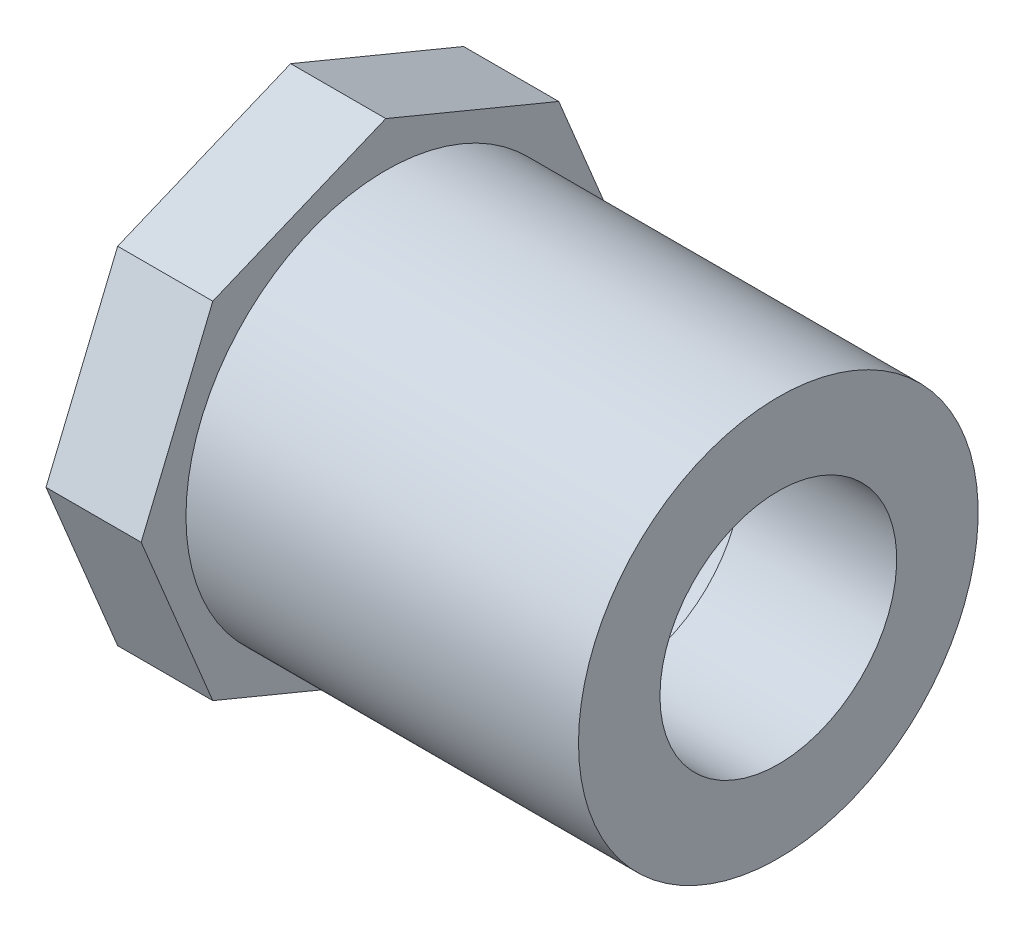
ISO-10303-21;
HEADER;
FILE_DESCRIPTION(('STEP AP214'),'2;1');
FILE_NAME('part.step','',(''),(''),'','','');
FILE_SCHEMA(('AUTOMOTIVE_DESIGN { 1 0 10303 214 1 1 1 1 }'));
ENDSEC;
DATA;
#1=APPLICATION_CONTEXT('core data for automotive mechanical design processes');
#2=APPLICATION_PROTOCOL_DEFINITION('international standard','automotive_design',2000,#1);
#3=PRODUCT_CONTEXT('',#1,'mechanical');
#4=PRODUCT('Part','Part','',(#3));
#5=PRODUCT_RELATED_PRODUCT_CATEGORY('part','',(#4));
#6=PRODUCT_DEFINITION_FORMATION('','',#4);
#7=PRODUCT_DEFINITION_CONTEXT('part definition',#1,'design');
#8=PRODUCT_DEFINITION('design','',#6,#7);
#9=PRODUCT_DEFINITION_SHAPE('','',#8);
#10=(LENGTH_UNIT() NAMED_UNIT(*) SI_UNIT(.MILLI.,.METRE.));
#11=(NAMED_UNIT(*) PLANE_ANGLE_UNIT() SI_UNIT($,.RADIAN.));
#12=(NAMED_UNIT(*) SI_UNIT($,.STERADIAN.) SOLID_ANGLE_UNIT());
#13=UNCERTAINTY_MEASURE_WITH_UNIT(LENGTH_MEASURE(1.E-05),#10,'distance_accuracy_value','');
#14=(GEOMETRIC_REPRESENTATION_CONTEXT(3) GLOBAL_UNCERTAINTY_ASSIGNED_CONTEXT((#13)) GLOBAL_UNIT_ASSIGNED_CONTEXT((#10,
#11,#12)) REPRESENTATION_CONTEXT('',''));
#15=CARTESIAN_POINT('',(0.,0.,0.));
#16=DIRECTION('',(0.,0.,1.));
#17=DIRECTION('',(1.,0.,0.));
#18=AXIS2_PLACEMENT_3D('',#15,#16,#17);
#19=CARTESIAN_POINT('',(-32.54375,0.,0.));
#20=DIRECTION('',(-1.,0.,0.));
#21=DIRECTION('',(0.,0.,1.));
#22=AXIS2_PLACEMENT_3D('',#19,#20,#21);
#23=CYLINDRICAL_SURFACE('',#22,13.335);
#24=CARTESIAN_POINT('',(0.,0.,0.));
#25=DIRECTION('',(-1.,0.,0.));
#26=DIRECTION('',(0.,0.,1.));
#27=AXIS2_PLACEMENT_3D('',#24,#25,#26);
#28=CIRCLE('',#27,13.335);
#29=CARTESIAN_POINT('',(0.,0.,13.335));
#30=VERTEX_POINT('',#29);
#31=EDGE_CURVE('E165',#30,#30,#28,.T.);
#32=ORIENTED_EDGE('',*,*,#31,.T.);
#33=EDGE_LOOP('',(#32));
#34=FACE_BOUND('',#33,.T.);
#35=CARTESIAN_POINT('',(-26.19375,0.,0.));
#36=DIRECTION('',(-1.,0.,0.));
#37=DIRECTION('',(0.,0.,1.));
#38=AXIS2_PLACEMENT_3D('',#35,#36,#37);
#39=CIRCLE('',#38,13.335);
#40=CARTESIAN_POINT('',(-26.19375,0.,13.335));
#41=VERTEX_POINT('',#40);
#42=EDGE_CURVE('E36',#41,#41,#39,.F.);
#43=ORIENTED_EDGE('',*,*,#42,.T.);
#44=EDGE_LOOP('',(#43));
#45=FACE_BOUND('',#44,.T.);
#46=ADVANCED_FACE('F32',(#34,#45),#23,.T.);
#47=CARTESIAN_POINT('',(-32.54375,-13.335,0.));
#48=DIRECTION('',(-1.,0.,0.));
#49=DIRECTION('',(0.,0.,1.));
#50=AXIS2_PLACEMENT_3D('',#47,#48,#49);
#51=PLANE('',#50);
#52=CARTESIAN_POINT('',(-32.54375,0.,0.));
#53=DIRECTION('',(-1.,0.,0.));
#54=DIRECTION('',(0.,0.,1.));
#55=AXIS2_PLACEMENT_3D('',#52,#53,#54);
#56=CIRCLE('',#55,10.7696);
#57=CARTESIAN_POINT('',(-32.54375,0.,10.7696));
#58=VERTEX_POINT('',#57);
#59=EDGE_CURVE('E11',#58,#58,#56,.T.);
#60=ORIENTED_EDGE('',*,*,#59,.F.);
#61=EDGE_LOOP('',(#60));
#62=FACE_BOUND('',#61,.T.);
#63=DIRECTION('',(0.,0.923879532511287,0.38268343236509));
#64=VECTOR('',#63,1.);
#65=CARTESIAN_POINT('',(-32.54375,-11.542689028712,11.542689028712));
#66=LINE('',#65,#64);
#67=CARTESIAN_POINT('',(-32.54375,-11.542689028712,11.542689028712));
#68=VERTEX_POINT('',#67);
#69=CARTESIAN_POINT('',(-32.54375,0.,16.3238273706597));
#70=VERTEX_POINT('',#69);
#71=EDGE_CURVE('E133',#68,#70,#66,.T.);
#72=ORIENTED_EDGE('',*,*,#71,.T.);
#73=DIRECTION('',(0.,0.923879532511287,-0.38268343236509));
#74=VECTOR('',#73,1.);
#75=CARTESIAN_POINT('',(-32.54375,0.,16.3238273706597));
#76=LINE('',#75,#74);
#77=CARTESIAN_POINT('',(-32.54375,11.542689028712,11.542689028712));
#78=VERTEX_POINT('',#77);
#79=EDGE_CURVE('E136',#70,#78,#76,.T.);
#80=ORIENTED_EDGE('',*,*,#79,.T.);
#81=DIRECTION('',(0.,0.38268343236509,-0.923879532511287));
#82=VECTOR('',#81,1.);
#83=CARTESIAN_POINT('',(-32.54375,11.542689028712,11.542689028712));
#84=LINE('',#83,#82);
#85=CARTESIAN_POINT('',(-32.54375,16.3238273706597,0.));
#86=VERTEX_POINT('',#85);
#87=EDGE_CURVE('E139',#78,#86,#84,.T.);
#88=ORIENTED_EDGE('',*,*,#87,.T.);
#89=DIRECTION('',(0.,-0.38268343236509,-0.923879532511287));
#90=VECTOR('',#89,1.);
#91=CARTESIAN_POINT('',(-32.54375,16.3238273706597,0.));
#92=LINE('',#91,#90);
#93=CARTESIAN_POINT('',(-32.54375,11.542689028712,-11.542689028712));
#94=VERTEX_POINT('',#93);
#95=EDGE_CURVE('E142',#86,#94,#92,.T.);
#96=ORIENTED_EDGE('',*,*,#95,.T.);
#97=DIRECTION('',(0.,-0.923879532511287,-0.38268343236509));
#98=VECTOR('',#97,1.);
#99=CARTESIAN_POINT('',(-32.54375,11.542689028712,-11.542689028712));
#100=LINE('',#99,#98);
#101=CARTESIAN_POINT('',(-32.54375,0.,-16.3238273706597));
#102=VERTEX_POINT('',#101);
#103=EDGE_CURVE('E145',#94,#102,#100,.T.);
#104=ORIENTED_EDGE('',*,*,#103,.T.);
#105=DIRECTION('',(0.,-0.923879532511287,0.382683432365089));
#106=VECTOR('',#105,1.);
#107=CARTESIAN_POINT('',(-32.54375,0.,-16.3238273706597));
#108=LINE('',#107,#106);
#109=CARTESIAN_POINT('',(-32.54375,-11.542689028712,-11.542689028712));
#110=VERTEX_POINT('',#109);
#111=EDGE_CURVE('E148',#102,#110,#108,.T.);
#112=ORIENTED_EDGE('',*,*,#111,.T.);
#113=DIRECTION('',(0.,-0.38268343236509,0.923879532511287));
#114=VECTOR('',#113,1.);
#115=CARTESIAN_POINT('',(-32.54375,-11.542689028712,-11.542689028712));
#116=LINE('',#115,#114);
#117=CARTESIAN_POINT('',(-32.54375,-16.3238273706597,0.));
#118=VERTEX_POINT('',#117);
#119=EDGE_CURVE('E110',#110,#118,#116,.T.);
#120=ORIENTED_EDGE('',*,*,#119,.T.);
#121=DIRECTION('',(0.,0.382683432365089,0.923879532511287));
#122=VECTOR('',#121,1.);
#123=CARTESIAN_POINT('',(-32.54375,-16.3238273706597,0.));
#124=LINE('',#123,#122);
#125=EDGE_CURVE('E151',#118,#68,#124,.T.);
#126=ORIENTED_EDGE('',*,*,#125,.T.);
#127=EDGE_LOOP('',(#72,#80,#88,#96,#104,#112,#120,#126));
#128=FACE_BOUND('',#127,.T.);
#129=ADVANCED_FACE('F34',(#62,#128),#51,.T.);
#130=CARTESIAN_POINT('',(-10.31875,0.,0.));
#131=DIRECTION('',(-1.,0.,0.));
#132=DIRECTION('',(0.,0.,1.));
#133=AXIS2_PLACEMENT_3D('',#130,#131,#132);
#134=CONICAL_SURFACE('',#133,10.6172,0.00685703538495623);
#135=ORIENTED_EDGE('',*,*,#59,.T.);
#136=EDGE_LOOP('',(#135));
#137=FACE_BOUND('',#136,.T.);
#138=CARTESIAN_POINT('',(-10.31875,0.,0.));
#139=DIRECTION('',(-1.,0.,0.));
#140=DIRECTION('',(0.,0.,1.));
#141=AXIS2_PLACEMENT_3D('',#138,#139,#140);
#142=CIRCLE('',#141,10.6172);
#143=CARTESIAN_POINT('',(-10.31875,0.,10.6172));
#144=VERTEX_POINT('',#143);
#145=EDGE_CURVE('E42',#144,#144,#142,.T.);
#146=ORIENTED_EDGE('',*,*,#145,.F.);
#147=EDGE_LOOP('',(#146));
#148=FACE_BOUND('',#147,.T.);
#149=ADVANCED_FACE('F180',(#137,#148),#134,.F.);
#150=CARTESIAN_POINT('',(-10.31875,-7.8994,0.));
#151=DIRECTION('',(-1.,0.,0.));
#152=DIRECTION('',(0.,0.,1.));
#153=AXIS2_PLACEMENT_3D('',#150,#151,#152);
#154=PLANE('',#153);
#155=ORIENTED_EDGE('',*,*,#145,.T.);
#156=EDGE_LOOP('',(#155));
#157=FACE_BOUND('',#156,.T.);
#158=CARTESIAN_POINT('',(-10.31875,0.,0.));
#159=DIRECTION('',(-1.,0.,0.));
#160=DIRECTION('',(0.,0.,1.));
#161=AXIS2_PLACEMENT_3D('',#158,#159,#160);
#162=CIRCLE('',#161,7.8994);
#163=CARTESIAN_POINT('',(-10.31875,0.,7.8994));
#164=VERTEX_POINT('',#163);
#165=EDGE_CURVE('E171',#164,#164,#162,.T.);
#166=ORIENTED_EDGE('',*,*,#165,.F.);
#167=EDGE_LOOP('',(#166));
#168=FACE_BOUND('',#167,.T.);
#169=ADVANCED_FACE('F177',(#157,#168),#154,.T.);
#170=CARTESIAN_POINT('',(-32.54375,0.,0.));
#171=DIRECTION('',(-1.,0.,0.));
#172=DIRECTION('',(0.,0.,1.));
#173=AXIS2_PLACEMENT_3D('',#170,#171,#172);
#174=CYLINDRICAL_SURFACE('',#173,7.8994);
#175=ORIENTED_EDGE('',*,*,#165,.T.);
#176=EDGE_LOOP('',(#175));
#177=FACE_BOUND('',#176,.T.);
#178=CARTESIAN_POINT('',(0.,0.,0.));
#179=DIRECTION('',(-1.,0.,0.));
#180=DIRECTION('',(0.,0.,1.));
#181=AXIS2_PLACEMENT_3D('',#178,#179,#180);
#182=CIRCLE('',#181,7.8994);
#183=CARTESIAN_POINT('',(0.,0.,7.8994));
#184=VERTEX_POINT('',#183);
#185=EDGE_CURVE('E168',#184,#184,#182,.T.);
#186=ORIENTED_EDGE('',*,*,#185,.F.);
#187=EDGE_LOOP('',(#186));
#188=FACE_BOUND('',#187,.T.);
#189=ADVANCED_FACE('F187',(#177,#188),#174,.F.);
#190=CARTESIAN_POINT('',(0.,-7.8994,0.));
#191=DIRECTION('',(1.,0.,0.));
#192=DIRECTION('',(0.,0.,-1.));
#193=AXIS2_PLACEMENT_3D('',#190,#191,#192);
#194=PLANE('',#193);
#195=ORIENTED_EDGE('',*,*,#185,.T.);
#196=EDGE_LOOP('',(#195));
#197=FACE_BOUND('',#196,.T.);
#198=ORIENTED_EDGE('',*,*,#31,.F.);
#199=EDGE_LOOP('',(#198));
#200=FACE_BOUND('',#199,.T.);
#201=ADVANCED_FACE('F200',(#197,#200),#194,.T.);
#202=CARTESIAN_POINT('',(-26.19375,-11.542689028712,11.542689028712));
#203=DIRECTION('',(0.,-0.38268343236509,0.923879532511287));
#204=DIRECTION('',(0.,-0.923879532511287,-0.38268343236509));
#205=AXIS2_PLACEMENT_3D('',#202,#203,#204);
#206=PLANE('',#205);
#207=ORIENTED_EDGE('',*,*,#71,.F.);
#208=DIRECTION('',(-1.,0.,0.));
#209=VECTOR('',#208,1.);
#210=CARTESIAN_POINT('',(-26.19375,-11.542689028712,11.542689028712));
#211=LINE('',#210,#209);
#212=CARTESIAN_POINT('',(-26.19375,-11.542689028712,11.542689028712));
#213=VERTEX_POINT('',#212);
#214=EDGE_CURVE('E50',#213,#68,#211,.T.);
#215=ORIENTED_EDGE('',*,*,#214,.F.);
#216=DIRECTION('',(0.,0.923879532511287,0.38268343236509));
#217=VECTOR('',#216,1.);
#218=CARTESIAN_POINT('',(-26.19375,-11.542689028712,11.542689028712));
#219=LINE('',#218,#217);
#220=CARTESIAN_POINT('',(-26.19375,0.,16.3238273706597));
#221=VERTEX_POINT('',#220);
#222=EDGE_CURVE('E154',#213,#221,#219,.T.);
#223=ORIENTED_EDGE('',*,*,#222,.T.);
#224=DIRECTION('',(-1.,0.,0.));
#225=VECTOR('',#224,1.);
#226=CARTESIAN_POINT('',(-26.19375,0.,16.3238273706597));
#227=LINE('',#226,#225);
#228=EDGE_CURVE('E91',#221,#70,#227,.T.);
#229=ORIENTED_EDGE('',*,*,#228,.T.);
#230=EDGE_LOOP('',(#207,#215,#223,#229));
#231=FACE_BOUND('',#230,.T.);
#232=ADVANCED_FACE('F198',(#231),#206,.T.);
#233=CARTESIAN_POINT('',(-26.19375,-16.3238273706597,0.));
#234=DIRECTION('',(0.,-0.923879532511287,0.382683432365089));
#235=DIRECTION('',(0.,-0.382683432365089,-0.923879532511287));
#236=AXIS2_PLACEMENT_3D('',#233,#234,#235);
#237=PLANE('',#236);
#238=ORIENTED_EDGE('',*,*,#125,.F.);
#239=DIRECTION('',(-1.,0.,0.));
#240=VECTOR('',#239,1.);
#241=CARTESIAN_POINT('',(-26.19375,-16.3238273706597,0.));
#242=LINE('',#241,#240);
#243=CARTESIAN_POINT('',(-26.19375,-16.3238273706597,0.));
#244=VERTEX_POINT('',#243);
#245=EDGE_CURVE('E79',#244,#118,#242,.T.);
#246=ORIENTED_EDGE('',*,*,#245,.F.);
#247=DIRECTION('',(0.,0.382683432365089,0.923879532511287));
#248=VECTOR('',#247,1.);
#249=CARTESIAN_POINT('',(-26.19375,-16.3238273706597,0.));
#250=LINE('',#249,#248);
#251=EDGE_CURVE('E123',#244,#213,#250,.T.);
#252=ORIENTED_EDGE('',*,*,#251,.T.);
#253=ORIENTED_EDGE('',*,*,#214,.T.);
#254=EDGE_LOOP('',(#238,#246,#252,#253));
#255=FACE_BOUND('',#254,.T.);
#256=ADVANCED_FACE('F225',(#255),#237,.T.);
#257=CARTESIAN_POINT('',(-26.19375,-11.542689028712,-11.542689028712));
#258=DIRECTION('',(0.,-0.923879532511287,-0.38268343236509));
#259=DIRECTION('',(0.,0.38268343236509,-0.923879532511287));
#260=AXIS2_PLACEMENT_3D('',#257,#258,#259);
#261=PLANE('',#260);
#262=ORIENTED_EDGE('',*,*,#119,.F.);
#263=DIRECTION('',(-1.,0.,0.));
#264=VECTOR('',#263,1.);
#265=CARTESIAN_POINT('',(-26.19375,-11.542689028712,-11.542689028712));
#266=LINE('',#265,#264);
#267=CARTESIAN_POINT('',(-26.19375,-11.542689028712,-11.542689028712));
#268=VERTEX_POINT('',#267);
#269=EDGE_CURVE('E105',#268,#110,#266,.T.);
#270=ORIENTED_EDGE('',*,*,#269,.F.);
#271=DIRECTION('',(0.,-0.38268343236509,0.923879532511287));
#272=VECTOR('',#271,1.);
#273=CARTESIAN_POINT('',(-26.19375,-11.542689028712,-11.542689028712));
#274=LINE('',#273,#272);
#275=EDGE_CURVE('E108',#268,#244,#274,.T.);
#276=ORIENTED_EDGE('',*,*,#275,.T.);
#277=ORIENTED_EDGE('',*,*,#245,.T.);
#278=EDGE_LOOP('',(#262,#270,#276,#277));
#279=FACE_BOUND('',#278,.T.);
#280=ADVANCED_FACE('F107',(#279),#261,.T.);
#281=CARTESIAN_POINT('',(-26.19375,0.,-16.3238273706597));
#282=DIRECTION('',(0.,-0.382683432365089,-0.923879532511287));
#283=DIRECTION('',(0.,0.923879532511287,-0.382683432365089));
#284=AXIS2_PLACEMENT_3D('',#281,#282,#283);
#285=PLANE('',#284);
#286=ORIENTED_EDGE('',*,*,#111,.F.);
#287=DIRECTION('',(-1.,0.,0.));
#288=VECTOR('',#287,1.);
#289=CARTESIAN_POINT('',(-26.19375,0.,-16.3238273706597));
#290=LINE('',#289,#288);
#291=CARTESIAN_POINT('',(-26.19375,0.,-16.3238273706597));
#292=VERTEX_POINT('',#291);
#293=EDGE_CURVE('E115',#292,#102,#290,.T.);
#294=ORIENTED_EDGE('',*,*,#293,.F.);
#295=DIRECTION('',(0.,-0.923879532511287,0.382683432365089));
#296=VECTOR('',#295,1.);
#297=CARTESIAN_POINT('',(-26.19375,0.,-16.3238273706597));
#298=LINE('',#297,#296);
#299=EDGE_CURVE('E121',#292,#268,#298,.T.);
#300=ORIENTED_EDGE('',*,*,#299,.T.);
#301=ORIENTED_EDGE('',*,*,#269,.T.);
#302=EDGE_LOOP('',(#286,#294,#300,#301));
#303=FACE_BOUND('',#302,.T.);
#304=ADVANCED_FACE('F125',(#303),#285,.T.);
#305=CARTESIAN_POINT('',(-26.19375,11.542689028712,-11.542689028712));
#306=DIRECTION('',(0.,0.38268343236509,-0.923879532511287));
#307=DIRECTION('',(0.,0.923879532511287,0.38268343236509));
#308=AXIS2_PLACEMENT_3D('',#305,#306,#307);
#309=PLANE('',#308);
#310=ORIENTED_EDGE('',*,*,#103,.F.);
#311=DIRECTION('',(-1.,0.,0.));
#312=VECTOR('',#311,1.);
#313=CARTESIAN_POINT('',(-26.19375,11.542689028712,-11.542689028712));
#314=LINE('',#313,#312);
#315=CARTESIAN_POINT('',(-26.19375,11.542689028712,-11.542689028712));
#316=VERTEX_POINT('',#315);
#317=EDGE_CURVE('E158',#316,#94,#314,.T.);
#318=ORIENTED_EDGE('',*,*,#317,.F.);
#319=DIRECTION('',(0.,-0.923879532511287,-0.38268343236509));
#320=VECTOR('',#319,1.);
#321=CARTESIAN_POINT('',(-26.19375,11.542689028712,-11.542689028712));
#322=LINE('',#321,#320);
#323=EDGE_CURVE('E126',#316,#292,#322,.T.);
#324=ORIENTED_EDGE('',*,*,#323,.T.);
#325=ORIENTED_EDGE('',*,*,#293,.T.);
#326=EDGE_LOOP('',(#310,#318,#324,#325));
#327=FACE_BOUND('',#326,.T.);
#328=ADVANCED_FACE('F244',(#327),#309,.T.);
#329=CARTESIAN_POINT('',(-26.19375,16.3238273706597,0.));
#330=DIRECTION('',(0.,0.923879532511287,-0.38268343236509));
#331=DIRECTION('',(0.,0.38268343236509,0.923879532511287));
#332=AXIS2_PLACEMENT_3D('',#329,#330,#331);
#333=PLANE('',#332);
#334=ORIENTED_EDGE('',*,*,#95,.F.);
#335=DIRECTION('',(-1.,0.,0.));
#336=VECTOR('',#335,1.);
#337=CARTESIAN_POINT('',(-26.19375,16.3238273706597,0.));
#338=LINE('',#337,#336);
#339=CARTESIAN_POINT('',(-26.19375,16.3238273706597,0.));
#340=VERTEX_POINT('',#339);
#341=EDGE_CURVE('E160',#340,#86,#338,.T.);
#342=ORIENTED_EDGE('',*,*,#341,.F.);
#343=DIRECTION('',(0.,-0.38268343236509,-0.923879532511287));
#344=VECTOR('',#343,1.);
#345=CARTESIAN_POINT('',(-26.19375,16.3238273706597,0.));
#346=LINE('',#345,#344);
#347=EDGE_CURVE('E128',#340,#316,#346,.T.);
#348=ORIENTED_EDGE('',*,*,#347,.T.);
#349=ORIENTED_EDGE('',*,*,#317,.T.);
#350=EDGE_LOOP('',(#334,#342,#348,#349));
#351=FACE_BOUND('',#350,.T.);
#352=ADVANCED_FACE('F251',(#351),#333,.T.);
#353=CARTESIAN_POINT('',(-26.19375,11.542689028712,11.542689028712));
#354=DIRECTION('',(0.,0.923879532511287,0.38268343236509));
#355=DIRECTION('',(0.,-0.38268343236509,0.923879532511287));
#356=AXIS2_PLACEMENT_3D('',#353,#354,#355);
#357=PLANE('',#356);
#358=ORIENTED_EDGE('',*,*,#87,.F.);
#359=DIRECTION('',(-1.,0.,0.));
#360=VECTOR('',#359,1.);
#361=CARTESIAN_POINT('',(-26.19375,11.542689028712,11.542689028712));
#362=LINE('',#361,#360);
#363=CARTESIAN_POINT('',(-26.19375,11.542689028712,11.542689028712));
#364=VERTEX_POINT('',#363);
#365=EDGE_CURVE('E162',#364,#78,#362,.T.);
#366=ORIENTED_EDGE('',*,*,#365,.F.);
#367=DIRECTION('',(0.,0.38268343236509,-0.923879532511287));
#368=VECTOR('',#367,1.);
#369=CARTESIAN_POINT('',(-26.19375,11.542689028712,11.542689028712));
#370=LINE('',#369,#368);
#371=EDGE_CURVE('E331',#364,#340,#370,.T.);
#372=ORIENTED_EDGE('',*,*,#371,.T.);
#373=ORIENTED_EDGE('',*,*,#341,.T.);
#374=EDGE_LOOP('',(#358,#366,#372,#373));
#375=FACE_BOUND('',#374,.T.);
#376=ADVANCED_FACE('F259',(#375),#357,.T.);
#377=CARTESIAN_POINT('',(-26.19375,0.,16.3238273706597));
#378=DIRECTION('',(0.,0.38268343236509,0.923879532511287));
#379=DIRECTION('',(0.,-0.923879532511287,0.38268343236509));
#380=AXIS2_PLACEMENT_3D('',#377,#378,#379);
#381=PLANE('',#380);
#382=ORIENTED_EDGE('',*,*,#79,.F.);
#383=ORIENTED_EDGE('',*,*,#228,.F.);
#384=DIRECTION('',(0.,0.923879532511287,-0.38268343236509));
#385=VECTOR('',#384,1.);
#386=CARTESIAN_POINT('',(-26.19375,0.,16.3238273706597));
#387=LINE('',#386,#385);
#388=EDGE_CURVE('E329',#221,#364,#387,.T.);
#389=ORIENTED_EDGE('',*,*,#388,.T.);
#390=ORIENTED_EDGE('',*,*,#365,.T.);
#391=EDGE_LOOP('',(#382,#383,#389,#390));
#392=FACE_BOUND('',#391,.T.);
#393=ADVANCED_FACE('F267',(#392),#381,.T.);
#394=CARTESIAN_POINT('',(-26.19375,8.16191368532984,19.7046027140419));
#395=DIRECTION('',(-1.,0.,0.));
#396=DIRECTION('',(0.,0.,1.));
#397=AXIS2_PLACEMENT_3D('',#394,#395,#396);
#398=PLANE('',#397);
#399=ORIENTED_EDGE('',*,*,#42,.F.);
#400=EDGE_LOOP('',(#399));
#401=FACE_BOUND('',#400,.T.);
#402=ORIENTED_EDGE('',*,*,#222,.F.);
#403=ORIENTED_EDGE('',*,*,#251,.F.);
#404=ORIENTED_EDGE('',*,*,#275,.F.);
#405=ORIENTED_EDGE('',*,*,#299,.F.);
#406=ORIENTED_EDGE('',*,*,#323,.F.);
#407=ORIENTED_EDGE('',*,*,#347,.F.);
#408=ORIENTED_EDGE('',*,*,#371,.F.);
#409=ORIENTED_EDGE('',*,*,#388,.F.);
#410=EDGE_LOOP('',(#402,#403,#404,#405,#406,#407,#408,#409));
#411=FACE_BOUND('',#410,.T.);
#412=ADVANCED_FACE('F119',(#401,#411),#398,.F.);
#413=CLOSED_SHELL('',(#46,#129,#149,#169,#189,#201,#232,#256,#280,#304,#328,#352,#376,#393,#412));
#414=MANIFOLD_SOLID_BREP('B2',#413);
#415=ADVANCED_BREP_SHAPE_REPRESENTATION('',(#18,#414),#14);
#416=SHAPE_DEFINITION_REPRESENTATION(#9,#415);
ENDSEC;
END-ISO-10303-21;
